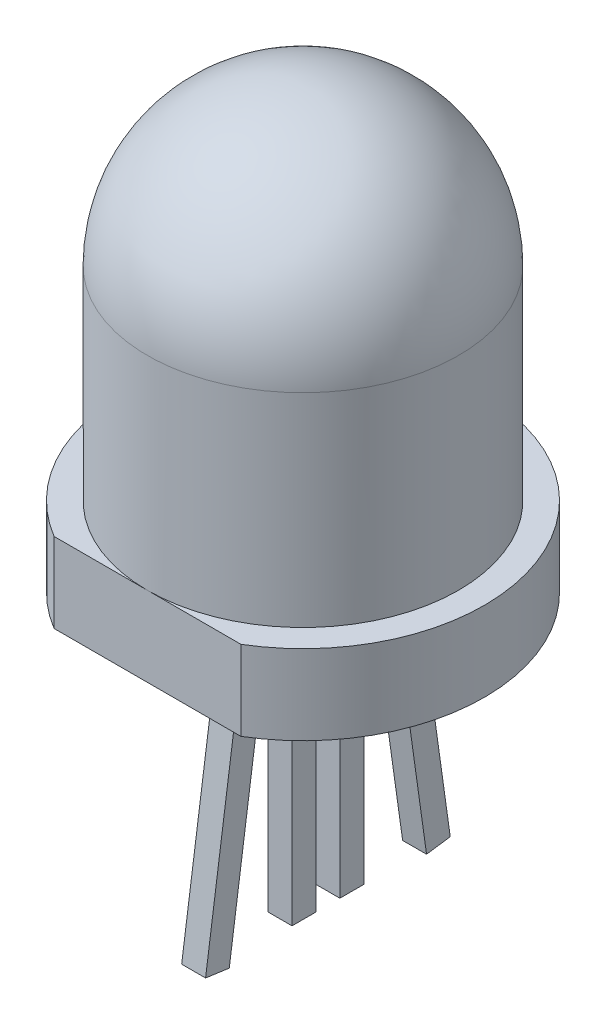
ISO-10303-21;
HEADER;
FILE_DESCRIPTION(('STEP AP214'),'2;1');
FILE_NAME('part.step','',(''),(''),'','','');
FILE_SCHEMA(('AUTOMOTIVE_DESIGN { 1 0 10303 214 1 1 1 1 }'));
ENDSEC;
DATA;
#1=APPLICATION_CONTEXT('core data for automotive mechanical design processes');
#2=APPLICATION_PROTOCOL_DEFINITION('international standard','automotive_design',2000,#1);
#3=PRODUCT_CONTEXT('',#1,'mechanical');
#4=PRODUCT('Part','Part','',(#3));
#5=PRODUCT_RELATED_PRODUCT_CATEGORY('part','',(#4));
#6=PRODUCT_DEFINITION_FORMATION('','',#4);
#7=PRODUCT_DEFINITION_CONTEXT('part definition',#1,'design');
#8=PRODUCT_DEFINITION('design','',#6,#7);
#9=PRODUCT_DEFINITION_SHAPE('','',#8);
#10=(LENGTH_UNIT() NAMED_UNIT(*) SI_UNIT(.MILLI.,.METRE.));
#11=(NAMED_UNIT(*) PLANE_ANGLE_UNIT() SI_UNIT($,.RADIAN.));
#12=(NAMED_UNIT(*) SI_UNIT($,.STERADIAN.) SOLID_ANGLE_UNIT());
#13=UNCERTAINTY_MEASURE_WITH_UNIT(LENGTH_MEASURE(1.E-05),#10,'distance_accuracy_value','');
#14=(GEOMETRIC_REPRESENTATION_CONTEXT(3) GLOBAL_UNCERTAINTY_ASSIGNED_CONTEXT((#13)) GLOBAL_UNIT_ASSIGNED_CONTEXT((#10,
#11,#12)) REPRESENTATION_CONTEXT('',''));
#15=CARTESIAN_POINT('',(0.,0.,0.));
#16=DIRECTION('',(0.,0.,1.));
#17=DIRECTION('',(1.,0.,0.));
#18=AXIS2_PLACEMENT_3D('',#15,#16,#17);
#19=CARTESIAN_POINT('',(0.,-2.,0.));
#20=DIRECTION('',(0.,-1.,0.));
#21=DIRECTION('',(0.,0.,-1.));
#22=AXIS2_PLACEMENT_3D('',#19,#20,#21);
#23=PLANE('',#22);
#24=DIRECTION('',(1.,0.,0.));
#25=VECTOR('',#24,1.);
#26=CARTESIAN_POINT('',(0.,-2.,1.78089654351117));
#27=LINE('',#26,#25);
#28=CARTESIAN_POINT('',(-0.3,-2.,1.78089654351117));
#29=VERTEX_POINT('',#28);
#30=CARTESIAN_POINT('',(0.3,-2.,1.78089654351117));
#31=VERTEX_POINT('',#30);
#32=EDGE_CURVE('E292',#29,#31,#27,.T.);
#33=ORIENTED_EDGE('',*,*,#32,.T.);
#34=DIRECTION('',(0.,0.,-1.));
#35=VECTOR('',#34,1.);
#36=CARTESIAN_POINT('',(0.3,-2.,0.));
#37=LINE('',#36,#35);
#38=CARTESIAN_POINT('',(0.3,-2.,1.175));
#39=VERTEX_POINT('',#38);
#40=EDGE_CURVE('E295',#31,#39,#37,.T.);
#41=ORIENTED_EDGE('',*,*,#40,.T.);
#42=DIRECTION('',(1.,0.,0.));
#43=VECTOR('',#42,1.);
#44=CARTESIAN_POINT('',(0.3,-2.,1.175));
#45=LINE('',#44,#43);
#46=CARTESIAN_POINT('',(-0.3,-2.,1.175));
#47=VERTEX_POINT('',#46);
#48=EDGE_CURVE('E181',#47,#39,#45,.T.);
#49=ORIENTED_EDGE('',*,*,#48,.F.);
#50=DIRECTION('',(0.,0.,1.));
#51=VECTOR('',#50,1.);
#52=CARTESIAN_POINT('',(-0.300000000000001,-2.,0.));
#53=LINE('',#52,#51);
#54=EDGE_CURVE('E289',#47,#29,#53,.T.);
#55=ORIENTED_EDGE('',*,*,#54,.T.);
#56=EDGE_LOOP('',(#33,#41,#49,#55));
#57=FACE_BOUND('',#56,.T.);
#58=DIRECTION('',(1.,0.,0.));
#59=VECTOR('',#58,1.);
#60=CARTESIAN_POINT('',(-0.3,-2.,-0.0250000000000005));
#61=LINE('',#60,#59);
#62=CARTESIAN_POINT('',(-0.3,-2.,-0.0250000000000005));
#63=VERTEX_POINT('',#62);
#64=CARTESIAN_POINT('',(0.3,-2.,-0.0250000000000004));
#65=VERTEX_POINT('',#64);
#66=EDGE_CURVE('E251',#63,#65,#61,.T.);
#67=ORIENTED_EDGE('',*,*,#66,.F.);
#68=DIRECTION('',(0.,0.,-1.));
#69=VECTOR('',#68,1.);
#70=CARTESIAN_POINT('',(-0.3,-2.,-0.0250000000000005));
#71=LINE('',#70,#69);
#72=CARTESIAN_POINT('',(-0.3,-2.,0.574999999999999));
#73=VERTEX_POINT('',#72);
#74=EDGE_CURVE('E237',#73,#63,#71,.T.);
#75=ORIENTED_EDGE('',*,*,#74,.F.);
#76=DIRECTION('',(-1.,0.,0.));
#77=VECTOR('',#76,1.);
#78=CARTESIAN_POINT('',(-0.3,-2.,0.574999999999999));
#79=LINE('',#78,#77);
#80=CARTESIAN_POINT('',(0.3,-2.,0.575));
#81=VERTEX_POINT('',#80);
#82=EDGE_CURVE('E242',#81,#73,#79,.T.);
#83=ORIENTED_EDGE('',*,*,#82,.F.);
#84=DIRECTION('',(0.,0.,1.));
#85=VECTOR('',#84,1.);
#86=CARTESIAN_POINT('',(0.3,-2.,-0.0250000000000004));
#87=LINE('',#86,#85);
#88=EDGE_CURVE('E253',#65,#81,#87,.T.);
#89=ORIENTED_EDGE('',*,*,#88,.F.);
#90=EDGE_LOOP('',(#67,#75,#83,#89));
#91=FACE_BOUND('',#90,.T.);
#92=CARTESIAN_POINT('',(0.,-2.,0.));
#93=DIRECTION('',(0.,-1.,0.));
#94=DIRECTION('',(0.,0.,-1.));
#95=AXIS2_PLACEMENT_3D('',#92,#93,#94);
#96=CIRCLE('',#95,4.55);
#97=CARTESIAN_POINT('',(-2.34360832905159,-2.,3.9));
#98=VERTEX_POINT('',#97);
#99=CARTESIAN_POINT('',(2.34360832905159,-2.,3.9));
#100=VERTEX_POINT('',#99);
#101=EDGE_CURVE('E267',#98,#100,#96,.T.);
#102=ORIENTED_EDGE('',*,*,#101,.T.);
#103=DIRECTION('',(-1.,0.,0.));
#104=VECTOR('',#103,1.);
#105=CARTESIAN_POINT('',(2.34360832905159,-2.,3.9));
#106=LINE('',#105,#104);
#107=EDGE_CURVE('E270',#100,#98,#106,.T.);
#108=ORIENTED_EDGE('',*,*,#107,.T.);
#109=EDGE_LOOP('',(#102,#108));
#110=FACE_BOUND('',#109,.T.);
#111=DIRECTION('',(-1.,0.,0.));
#112=VECTOR('',#111,1.);
#113=CARTESIAN_POINT('',(0.299999999999999,-2.,-0.625));
#114=LINE('',#113,#112);
#115=CARTESIAN_POINT('',(0.299999999999999,-2.,-0.625));
#116=VERTEX_POINT('',#115);
#117=CARTESIAN_POINT('',(-0.3,-2.,-0.625));
#118=VERTEX_POINT('',#117);
#119=EDGE_CURVE('E222',#116,#118,#114,.T.);
#120=ORIENTED_EDGE('',*,*,#119,.F.);
#121=DIRECTION('',(0.,0.,1.));
#122=VECTOR('',#121,1.);
#123=CARTESIAN_POINT('',(0.299999999999999,-2.,-1.225));
#124=LINE('',#123,#122);
#125=CARTESIAN_POINT('',(0.299999999999999,-2.,-1.225));
#126=VERTEX_POINT('',#125);
#127=EDGE_CURVE('E208',#126,#116,#124,.T.);
#128=ORIENTED_EDGE('',*,*,#127,.F.);
#129=DIRECTION('',(1.,0.,0.));
#130=VECTOR('',#129,1.);
#131=CARTESIAN_POINT('',(0.299999999999999,-2.,-1.225));
#132=LINE('',#131,#130);
#133=CARTESIAN_POINT('',(-0.3,-2.,-1.225));
#134=VERTEX_POINT('',#133);
#135=EDGE_CURVE('E213',#134,#126,#132,.T.);
#136=ORIENTED_EDGE('',*,*,#135,.F.);
#137=DIRECTION('',(0.,0.,-1.));
#138=VECTOR('',#137,1.);
#139=CARTESIAN_POINT('',(-0.3,-2.,-1.225));
#140=LINE('',#139,#138);
#141=EDGE_CURVE('E224',#118,#134,#140,.T.);
#142=ORIENTED_EDGE('',*,*,#141,.F.);
#143=EDGE_LOOP('',(#120,#128,#136,#142));
#144=FACE_BOUND('',#143,.T.);
#145=DIRECTION('',(-1.,0.,0.));
#146=VECTOR('',#145,1.);
#147=CARTESIAN_POINT('',(0.299999999999999,-2.,-1.825));
#148=LINE('',#147,#146);
#149=CARTESIAN_POINT('',(0.299999999999999,-2.,-1.82500000000001));
#150=VERTEX_POINT('',#149);
#151=CARTESIAN_POINT('',(-0.300000000000001,-2.,-1.825));
#152=VERTEX_POINT('',#151);
#153=EDGE_CURVE('E178',#150,#152,#148,.T.);
#154=ORIENTED_EDGE('',*,*,#153,.F.);
#155=DIRECTION('',(0.,0.,-1.));
#156=VECTOR('',#155,1.);
#157=CARTESIAN_POINT('',(0.299999999999999,-2.,0.));
#158=LINE('',#157,#156);
#159=CARTESIAN_POINT('',(0.299999999999999,-2.,-2.43089654351117));
#160=VERTEX_POINT('',#159);
#161=EDGE_CURVE('E11',#150,#160,#158,.T.);
#162=ORIENTED_EDGE('',*,*,#161,.T.);
#163=DIRECTION('',(-1.,0.,0.));
#164=VECTOR('',#163,1.);
#165=CARTESIAN_POINT('',(0.,-2.,-2.43089654351117));
#166=LINE('',#165,#164);
#167=CARTESIAN_POINT('',(-0.3,-2.,-2.43089654351117));
#168=VERTEX_POINT('',#167);
#169=EDGE_CURVE('E43',#160,#168,#166,.T.);
#170=ORIENTED_EDGE('',*,*,#169,.T.);
#171=DIRECTION('',(0.,0.,1.));
#172=VECTOR('',#171,1.);
#173=CARTESIAN_POINT('',(-0.300000000000001,-2.,0.));
#174=LINE('',#173,#172);
#175=EDGE_CURVE('E298',#168,#152,#174,.T.);
#176=ORIENTED_EDGE('',*,*,#175,.T.);
#177=EDGE_LOOP('',(#154,#162,#170,#176));
#178=FACE_BOUND('',#177,.T.);
#179=ADVANCED_FACE('F35',(#57,#91,#110,#144,#178),#23,.T.);
#180=CARTESIAN_POINT('',(0.,9.,0.));
#181=DIRECTION('',(0.,-1.,0.));
#182=DIRECTION('',(0.,0.,-1.));
#183=AXIS2_PLACEMENT_3D('',#180,#181,#182);
#184=CYLINDRICAL_SURFACE('',#183,3.9);
#185=CARTESIAN_POINT('',(0.,5.1,0.));
#186=DIRECTION('',(0.,-1.,0.));
#187=DIRECTION('',(0.,0.,-1.));
#188=AXIS2_PLACEMENT_3D('',#185,#186,#187);
#189=CIRCLE('',#188,3.9);
#190=CARTESIAN_POINT('',(0.,5.1,-3.9));
#191=VERTEX_POINT('',#190);
#192=EDGE_CURVE('E286',#191,#191,#189,.T.);
#193=ORIENTED_EDGE('',*,*,#192,.T.);
#194=EDGE_LOOP('',(#193));
#195=FACE_BOUND('',#194,.T.);
#196=CARTESIAN_POINT('',(0.,0.,0.));
#197=DIRECTION('',(0.,1.,0.));
#198=DIRECTION('',(0.,0.,1.));
#199=AXIS2_PLACEMENT_3D('',#196,#197,#198);
#200=CIRCLE('',#199,3.9);
#201=CARTESIAN_POINT('',(0.,0.,3.9));
#202=VERTEX_POINT('',#201);
#203=EDGE_CURVE('E283',#202,#202,#200,.T.);
#204=ORIENTED_EDGE('',*,*,#203,.T.);
#205=EDGE_LOOP('',(#204));
#206=FACE_BOUND('',#205,.T.);
#207=ADVANCED_FACE('F319',(#195,#206),#184,.T.);
#208=CARTESIAN_POINT('',(0.,5.1,0.));
#209=DIRECTION('',(0.,0.,1.));
#210=DIRECTION('',(1.,0.,0.));
#211=AXIS2_PLACEMENT_3D('',#208,#209,#210);
#212=SPHERICAL_SURFACE('',#211,3.9);
#213=CARTESIAN_POINT('',(0.,5.1,0.));
#214=DIRECTION('',(0.,-1.,0.));
#215=DIRECTION('',(0.,0.,-1.));
#216=AXIS2_PLACEMENT_3D('',#213,#214,#215);
#217=SPHERICAL_SURFACE('',#216,3.9);
#218=ORIENTED_EDGE('',*,*,#192,.F.);
#219=EDGE_LOOP('',(#218));
#220=FACE_BOUND('',#219,.T.);
#221=ADVANCED_FACE('F37',(#220),#217,.T.);
#222=CARTESIAN_POINT('',(0.,-2.,0.));
#223=DIRECTION('',(0.,1.,0.));
#224=DIRECTION('',(0.,0.,1.));
#225=AXIS2_PLACEMENT_3D('',#222,#223,#224);
#226=CYLINDRICAL_SURFACE('',#225,4.55);
#227=CARTESIAN_POINT('',(0.,0.,0.));
#228=DIRECTION('',(0.,-1.,0.));
#229=DIRECTION('',(0.,0.,-1.));
#230=AXIS2_PLACEMENT_3D('',#227,#228,#229);
#231=CIRCLE('',#230,4.55);
#232=CARTESIAN_POINT('',(-2.34360832905159,0.,3.9));
#233=VERTEX_POINT('',#232);
#234=CARTESIAN_POINT('',(2.34360832905159,0.,3.9));
#235=VERTEX_POINT('',#234);
#236=EDGE_CURVE('E266',#233,#235,#231,.T.);
#237=ORIENTED_EDGE('',*,*,#236,.T.);
#238=DIRECTION('',(0.,1.,0.));
#239=VECTOR('',#238,1.);
#240=CARTESIAN_POINT('',(2.34360832905159,-2.,3.9));
#241=LINE('',#240,#239);
#242=EDGE_CURVE('E280',#100,#235,#241,.T.);
#243=ORIENTED_EDGE('',*,*,#242,.F.);
#244=ORIENTED_EDGE('',*,*,#101,.F.);
#245=DIRECTION('',(0.,1.,0.));
#246=VECTOR('',#245,1.);
#247=CARTESIAN_POINT('',(-2.34360832905159,-2.,3.9));
#248=LINE('',#247,#246);
#249=EDGE_CURVE('E273',#98,#233,#248,.T.);
#250=ORIENTED_EDGE('',*,*,#249,.T.);
#251=EDGE_LOOP('',(#237,#243,#244,#250));
#252=FACE_BOUND('',#251,.T.);
#253=ADVANCED_FACE('F338',(#252),#226,.T.);
#254=CARTESIAN_POINT('',(2.34360832905159,-2.,3.9));
#255=DIRECTION('',(0.,0.,-1.));
#256=DIRECTION('',(-1.,0.,0.));
#257=AXIS2_PLACEMENT_3D('',#254,#255,#256);
#258=PLANE('',#257);
#259=DIRECTION('',(-1.,0.,0.));
#260=VECTOR('',#259,1.);
#261=CARTESIAN_POINT('',(2.34360832905159,0.,3.9));
#262=LINE('',#261,#260);
#263=EDGE_CURVE('E271',#235,#202,#262,.T.);
#264=ORIENTED_EDGE('',*,*,#263,.T.);
#265=EDGE_CURVE('E276',#202,#233,#262,.T.);
#266=ORIENTED_EDGE('',*,*,#265,.T.);
#267=ORIENTED_EDGE('',*,*,#249,.F.);
#268=ORIENTED_EDGE('',*,*,#107,.F.);
#269=ORIENTED_EDGE('',*,*,#242,.T.);
#270=EDGE_LOOP('',(#264,#266,#267,#268,#269));
#271=FACE_BOUND('',#270,.T.);
#272=ADVANCED_FACE('F334',(#271),#258,.F.);
#273=CARTESIAN_POINT('',(0.,0.,0.));
#274=DIRECTION('',(0.,-1.,0.));
#275=DIRECTION('',(0.,0.,-1.));
#276=AXIS2_PLACEMENT_3D('',#273,#274,#275);
#277=PLANE('',#276);
#278=ORIENTED_EDGE('',*,*,#265,.F.);
#279=ORIENTED_EDGE('',*,*,#203,.F.);
#280=ORIENTED_EDGE('',*,*,#263,.F.);
#281=ORIENTED_EDGE('',*,*,#236,.F.);
#282=EDGE_LOOP('',(#278,#279,#280,#281));
#283=FACE_BOUND('',#282,.T.);
#284=ADVANCED_FACE('F331',(#283),#277,.F.);
#285=CARTESIAN_POINT('',(-0.3,-8.8,-0.0250000000000005));
#286=DIRECTION('',(1.,0.,0.));
#287=DIRECTION('',(0.,0.,-1.));
#288=AXIS2_PLACEMENT_3D('',#285,#286,#287);
#289=PLANE('',#288);
#290=ORIENTED_EDGE('',*,*,#74,.T.);
#291=DIRECTION('',(0.,1.,0.));
#292=VECTOR('',#291,1.);
#293=CARTESIAN_POINT('',(-0.3,-8.8,-0.0250000000000005));
#294=LINE('',#293,#292);
#295=CARTESIAN_POINT('',(-0.3,-8.8,-0.0250000000000005));
#296=VERTEX_POINT('',#295);
#297=EDGE_CURVE('E264',#296,#63,#294,.T.);
#298=ORIENTED_EDGE('',*,*,#297,.F.);
#299=DIRECTION('',(0.,0.,-1.));
#300=VECTOR('',#299,1.);
#301=CARTESIAN_POINT('',(-0.3,-8.8,-0.0250000000000005));
#302=LINE('',#301,#300);
#303=CARTESIAN_POINT('',(-0.3,-8.8,0.574999999999999));
#304=VERTEX_POINT('',#303);
#305=EDGE_CURVE('E238',#304,#296,#302,.T.);
#306=ORIENTED_EDGE('',*,*,#305,.F.);
#307=DIRECTION('',(0.,1.,0.));
#308=VECTOR('',#307,1.);
#309=CARTESIAN_POINT('',(-0.3,-8.8,0.574999999999999));
#310=LINE('',#309,#308);
#311=EDGE_CURVE('E248',#304,#73,#310,.T.);
#312=ORIENTED_EDGE('',*,*,#311,.T.);
#313=EDGE_LOOP('',(#290,#298,#306,#312));
#314=FACE_BOUND('',#313,.T.);
#315=ADVANCED_FACE('F329',(#314),#289,.F.);
#316=CARTESIAN_POINT('',(-0.3,-8.8,-0.0250000000000005));
#317=DIRECTION('',(0.,0.,1.));
#318=DIRECTION('',(1.,0.,0.));
#319=AXIS2_PLACEMENT_3D('',#316,#317,#318);
#320=PLANE('',#319);
#321=ORIENTED_EDGE('',*,*,#66,.T.);
#322=DIRECTION('',(0.,1.,0.));
#323=VECTOR('',#322,1.);
#324=CARTESIAN_POINT('',(0.3,-8.8,-0.0250000000000004));
#325=LINE('',#324,#323);
#326=CARTESIAN_POINT('',(0.3,-8.8,-0.0250000000000004));
#327=VERTEX_POINT('',#326);
#328=EDGE_CURVE('E261',#327,#65,#325,.T.);
#329=ORIENTED_EDGE('',*,*,#328,.F.);
#330=DIRECTION('',(1.,0.,0.));
#331=VECTOR('',#330,1.);
#332=CARTESIAN_POINT('',(-0.3,-8.8,-0.0250000000000005));
#333=LINE('',#332,#331);
#334=EDGE_CURVE('E241',#296,#327,#333,.T.);
#335=ORIENTED_EDGE('',*,*,#334,.F.);
#336=ORIENTED_EDGE('',*,*,#297,.T.);
#337=EDGE_LOOP('',(#321,#329,#335,#336));
#338=FACE_BOUND('',#337,.T.);
#339=ADVANCED_FACE('F400',(#338),#320,.F.);
#340=CARTESIAN_POINT('',(0.3,-8.8,-0.0250000000000004));
#341=DIRECTION('',(-1.,0.,0.));
#342=DIRECTION('',(0.,0.,1.));
#343=AXIS2_PLACEMENT_3D('',#340,#341,#342);
#344=PLANE('',#343);
#345=ORIENTED_EDGE('',*,*,#88,.T.);
#346=DIRECTION('',(0.,1.,0.));
#347=VECTOR('',#346,1.);
#348=CARTESIAN_POINT('',(0.3,-8.8,0.575));
#349=LINE('',#348,#347);
#350=CARTESIAN_POINT('',(0.3,-8.8,0.575));
#351=VERTEX_POINT('',#350);
#352=EDGE_CURVE('E259',#351,#81,#349,.T.);
#353=ORIENTED_EDGE('',*,*,#352,.F.);
#354=DIRECTION('',(0.,0.,1.));
#355=VECTOR('',#354,1.);
#356=CARTESIAN_POINT('',(0.3,-8.8,-0.0250000000000004));
#357=LINE('',#356,#355);
#358=EDGE_CURVE('E244',#327,#351,#357,.T.);
#359=ORIENTED_EDGE('',*,*,#358,.F.);
#360=ORIENTED_EDGE('',*,*,#328,.T.);
#361=EDGE_LOOP('',(#345,#353,#359,#360));
#362=FACE_BOUND('',#361,.T.);
#363=ADVANCED_FACE('F397',(#362),#344,.F.);
#364=CARTESIAN_POINT('',(-0.3,-8.8,0.574999999999999));
#365=DIRECTION('',(0.,0.,-1.));
#366=DIRECTION('',(-1.,0.,0.));
#367=AXIS2_PLACEMENT_3D('',#364,#365,#366);
#368=PLANE('',#367);
#369=ORIENTED_EDGE('',*,*,#82,.T.);
#370=ORIENTED_EDGE('',*,*,#311,.F.);
#371=DIRECTION('',(-1.,0.,0.));
#372=VECTOR('',#371,1.);
#373=CARTESIAN_POINT('',(-0.3,-8.8,0.574999999999999));
#374=LINE('',#373,#372);
#375=EDGE_CURVE('E246',#351,#304,#374,.T.);
#376=ORIENTED_EDGE('',*,*,#375,.F.);
#377=ORIENTED_EDGE('',*,*,#352,.T.);
#378=EDGE_LOOP('',(#369,#370,#376,#377));
#379=FACE_BOUND('',#378,.T.);
#380=ADVANCED_FACE('F393',(#379),#368,.F.);
#381=CARTESIAN_POINT('',(0.,-8.8,0.));
#382=DIRECTION('',(0.,1.,0.));
#383=DIRECTION('',(0.,0.,1.));
#384=AXIS2_PLACEMENT_3D('',#381,#382,#383);
#385=PLANE('',#384);
#386=ORIENTED_EDGE('',*,*,#305,.T.);
#387=ORIENTED_EDGE('',*,*,#334,.T.);
#388=ORIENTED_EDGE('',*,*,#358,.T.);
#389=ORIENTED_EDGE('',*,*,#375,.T.);
#390=EDGE_LOOP('',(#386,#387,#388,#389));
#391=FACE_BOUND('',#390,.T.);
#392=ADVANCED_FACE('F390',(#391),#385,.F.);
#393=CARTESIAN_POINT('',(0.299999999999999,-8.8,-1.225));
#394=DIRECTION('',(-1.,0.,0.));
#395=DIRECTION('',(0.,0.,1.));
#396=AXIS2_PLACEMENT_3D('',#393,#394,#395);
#397=PLANE('',#396);
#398=ORIENTED_EDGE('',*,*,#127,.T.);
#399=DIRECTION('',(0.,1.,0.));
#400=VECTOR('',#399,1.);
#401=CARTESIAN_POINT('',(0.299999999999999,-8.8,-0.625));
#402=LINE('',#401,#400);
#403=CARTESIAN_POINT('',(0.299999999999999,-8.8,-0.625));
#404=VERTEX_POINT('',#403);
#405=EDGE_CURVE('E235',#404,#116,#402,.T.);
#406=ORIENTED_EDGE('',*,*,#405,.F.);
#407=DIRECTION('',(0.,0.,1.));
#408=VECTOR('',#407,1.);
#409=CARTESIAN_POINT('',(0.299999999999999,-8.8,-1.225));
#410=LINE('',#409,#408);
#411=CARTESIAN_POINT('',(0.299999999999999,-8.8,-1.225));
#412=VERTEX_POINT('',#411);
#413=EDGE_CURVE('E209',#412,#404,#410,.T.);
#414=ORIENTED_EDGE('',*,*,#413,.F.);
#415=DIRECTION('',(0.,1.,0.));
#416=VECTOR('',#415,1.);
#417=CARTESIAN_POINT('',(0.299999999999999,-8.8,-1.225));
#418=LINE('',#417,#416);
#419=EDGE_CURVE('E219',#412,#126,#418,.T.);
#420=ORIENTED_EDGE('',*,*,#419,.T.);
#421=EDGE_LOOP('',(#398,#406,#414,#420));
#422=FACE_BOUND('',#421,.T.);
#423=ADVANCED_FACE('F372',(#422),#397,.F.);
#424=CARTESIAN_POINT('',(0.299999999999999,-8.8,-0.625));
#425=DIRECTION('',(0.,0.,-1.));
#426=DIRECTION('',(-1.,0.,0.));
#427=AXIS2_PLACEMENT_3D('',#424,#425,#426);
#428=PLANE('',#427);
#429=ORIENTED_EDGE('',*,*,#119,.T.);
#430=DIRECTION('',(0.,1.,0.));
#431=VECTOR('',#430,1.);
#432=CARTESIAN_POINT('',(-0.3,-8.8,-0.625));
#433=LINE('',#432,#431);
#434=CARTESIAN_POINT('',(-0.3,-8.8,-0.625));
#435=VERTEX_POINT('',#434);
#436=EDGE_CURVE('E232',#435,#118,#433,.T.);
#437=ORIENTED_EDGE('',*,*,#436,.F.);
#438=DIRECTION('',(-1.,0.,0.));
#439=VECTOR('',#438,1.);
#440=CARTESIAN_POINT('',(0.299999999999999,-8.8,-0.625));
#441=LINE('',#440,#439);
#442=EDGE_CURVE('E212',#404,#435,#441,.T.);
#443=ORIENTED_EDGE('',*,*,#442,.F.);
#444=ORIENTED_EDGE('',*,*,#405,.T.);
#445=EDGE_LOOP('',(#429,#437,#443,#444));
#446=FACE_BOUND('',#445,.T.);
#447=ADVANCED_FACE('F360',(#446),#428,.F.);
#448=CARTESIAN_POINT('',(-0.3,-8.8,-1.225));
#449=DIRECTION('',(1.,0.,0.));
#450=DIRECTION('',(0.,0.,-1.));
#451=AXIS2_PLACEMENT_3D('',#448,#449,#450);
#452=PLANE('',#451);
#453=ORIENTED_EDGE('',*,*,#141,.T.);
#454=DIRECTION('',(0.,1.,0.));
#455=VECTOR('',#454,1.);
#456=CARTESIAN_POINT('',(-0.3,-8.8,-1.225));
#457=LINE('',#456,#455);
#458=CARTESIAN_POINT('',(-0.3,-8.8,-1.225));
#459=VERTEX_POINT('',#458);
#460=EDGE_CURVE('E230',#459,#134,#457,.T.);
#461=ORIENTED_EDGE('',*,*,#460,.F.);
#462=DIRECTION('',(0.,0.,-1.));
#463=VECTOR('',#462,1.);
#464=CARTESIAN_POINT('',(-0.3,-8.8,-1.225));
#465=LINE('',#464,#463);
#466=EDGE_CURVE('E215',#435,#459,#465,.T.);
#467=ORIENTED_EDGE('',*,*,#466,.F.);
#468=ORIENTED_EDGE('',*,*,#436,.T.);
#469=EDGE_LOOP('',(#453,#461,#467,#468));
#470=FACE_BOUND('',#469,.T.);
#471=ADVANCED_FACE('F364',(#470),#452,.F.);
#472=CARTESIAN_POINT('',(0.299999999999999,-8.8,-1.225));
#473=DIRECTION('',(0.,0.,1.));
#474=DIRECTION('',(1.,0.,0.));
#475=AXIS2_PLACEMENT_3D('',#472,#473,#474);
#476=PLANE('',#475);
#477=ORIENTED_EDGE('',*,*,#135,.T.);
#478=ORIENTED_EDGE('',*,*,#419,.F.);
#479=DIRECTION('',(1.,0.,0.));
#480=VECTOR('',#479,1.);
#481=CARTESIAN_POINT('',(0.299999999999999,-8.8,-1.225));
#482=LINE('',#481,#480);
#483=EDGE_CURVE('E217',#459,#412,#482,.T.);
#484=ORIENTED_EDGE('',*,*,#483,.F.);
#485=ORIENTED_EDGE('',*,*,#460,.T.);
#486=EDGE_LOOP('',(#477,#478,#484,#485));
#487=FACE_BOUND('',#486,.T.);
#488=ADVANCED_FACE('F374',(#487),#476,.F.);
#489=CARTESIAN_POINT('',(0.,-8.8,0.));
#490=DIRECTION('',(0.,-1.,0.));
#491=DIRECTION('',(0.,0.,-1.));
#492=AXIS2_PLACEMENT_3D('',#489,#490,#491);
#493=PLANE('',#492);
#494=ORIENTED_EDGE('',*,*,#413,.T.);
#495=ORIENTED_EDGE('',*,*,#442,.T.);
#496=ORIENTED_EDGE('',*,*,#466,.T.);
#497=ORIENTED_EDGE('',*,*,#483,.T.);
#498=EDGE_LOOP('',(#494,#495,#496,#497));
#499=FACE_BOUND('',#498,.T.);
#500=ADVANCED_FACE('F368',(#499),#493,.T.);
#501=CARTESIAN_POINT('',(0.3,-8.93187648119099,2.14921170672046));
#502=DIRECTION('',(-1.,0.,0.));
#503=DIRECTION('',(0.,0.,1.));
#504=AXIS2_PLACEMENT_3D('',#501,#502,#503);
#505=PLANE('',#504);
#506=ORIENTED_EDGE('',*,*,#40,.F.);
#507=DIRECTION('',(0.,0.99026806874157,-0.139173100960066));
#508=VECTOR('',#507,1.);
#509=CARTESIAN_POINT('',(0.3,-8.84837262061495,2.7433725479654));
#510=LINE('',#509,#508);
#511=CARTESIAN_POINT('',(0.3,-8.84837262061495,2.7433725479654));
#512=VERTEX_POINT('',#511);
#513=EDGE_CURVE('E205',#512,#31,#510,.T.);
#514=ORIENTED_EDGE('',*,*,#513,.F.);
#515=DIRECTION('',(0.,0.139173100960065,0.99026806874157));
#516=VECTOR('',#515,1.);
#517=CARTESIAN_POINT('',(0.3,-8.93187648119099,2.14921170672046));
#518=LINE('',#517,#516);
#519=CARTESIAN_POINT('',(0.3,-8.93187648119099,2.14921170672046));
#520=VERTEX_POINT('',#519);
#521=EDGE_CURVE('E183',#520,#512,#518,.T.);
#522=ORIENTED_EDGE('',*,*,#521,.F.);
#523=DIRECTION('',(0.,0.99026806874157,-0.139173100960066));
#524=VECTOR('',#523,1.);
#525=CARTESIAN_POINT('',(0.3,-8.93187648119099,2.14921170672046));
#526=LINE('',#525,#524);
#527=EDGE_CURVE('E196',#520,#39,#526,.T.);
#528=ORIENTED_EDGE('',*,*,#527,.T.);
#529=EDGE_LOOP('',(#506,#514,#522,#528));
#530=FACE_BOUND('',#529,.T.);
#531=ADVANCED_FACE('F381',(#530),#505,.F.);
#532=CARTESIAN_POINT('',(0.3,-8.84837262061495,2.7433725479654));
#533=DIRECTION('',(0.,-0.139173100960066,-0.99026806874157));
#534=DIRECTION('',(0.,0.99026806874157,-0.139173100960066));
#535=AXIS2_PLACEMENT_3D('',#532,#533,#534);
#536=PLANE('',#535);
#537=ORIENTED_EDGE('',*,*,#32,.F.);
#538=DIRECTION('',(0.,0.99026806874157,-0.139173100960066));
#539=VECTOR('',#538,1.);
#540=CARTESIAN_POINT('',(-0.3,-8.84837262061495,2.7433725479654));
#541=LINE('',#540,#539);
#542=CARTESIAN_POINT('',(-0.3,-8.84837262061495,2.7433725479654));
#543=VERTEX_POINT('',#542);
#544=EDGE_CURVE('E202',#543,#29,#541,.T.);
#545=ORIENTED_EDGE('',*,*,#544,.F.);
#546=DIRECTION('',(-1.,0.,0.));
#547=VECTOR('',#546,1.);
#548=CARTESIAN_POINT('',(0.3,-8.84837262061495,2.7433725479654));
#549=LINE('',#548,#547);
#550=EDGE_CURVE('E191',#512,#543,#549,.T.);
#551=ORIENTED_EDGE('',*,*,#550,.F.);
#552=ORIENTED_EDGE('',*,*,#513,.T.);
#553=EDGE_LOOP('',(#537,#545,#551,#552));
#554=FACE_BOUND('',#553,.T.);
#555=ADVANCED_FACE('F512',(#554),#536,.F.);
#556=CARTESIAN_POINT('',(-0.3,-8.93187648119099,2.14921170672046));
#557=DIRECTION('',(1.,0.,0.));
#558=DIRECTION('',(0.,0.,-1.));
#559=AXIS2_PLACEMENT_3D('',#556,#557,#558);
#560=PLANE('',#559);
#561=ORIENTED_EDGE('',*,*,#54,.F.);
#562=DIRECTION('',(0.,0.99026806874157,-0.139173100960066));
#563=VECTOR('',#562,1.);
#564=CARTESIAN_POINT('',(-0.3,-8.93187648119099,2.14921170672046));
#565=LINE('',#564,#563);
#566=CARTESIAN_POINT('',(-0.3,-8.93187648119099,2.14921170672046));
#567=VERTEX_POINT('',#566);
#568=EDGE_CURVE('E200',#567,#47,#565,.T.);
#569=ORIENTED_EDGE('',*,*,#568,.F.);
#570=DIRECTION('',(0.,-0.139173100960065,-0.99026806874157));
#571=VECTOR('',#570,1.);
#572=CARTESIAN_POINT('',(-0.3,-8.93187648119099,2.14921170672046));
#573=LINE('',#572,#571);
#574=EDGE_CURVE('E193',#543,#567,#573,.T.);
#575=ORIENTED_EDGE('',*,*,#574,.F.);
#576=ORIENTED_EDGE('',*,*,#544,.T.);
#577=EDGE_LOOP('',(#561,#569,#575,#576));
#578=FACE_BOUND('',#577,.T.);
#579=ADVANCED_FACE('F520',(#578),#560,.F.);
#580=CARTESIAN_POINT('',(0.3,-8.93187648119099,2.14921170672046));
#581=DIRECTION('',(0.,0.139173100960066,0.99026806874157));
#582=DIRECTION('',(0.,-0.99026806874157,0.139173100960066));
#583=AXIS2_PLACEMENT_3D('',#580,#581,#582);
#584=PLANE('',#583);
#585=ORIENTED_EDGE('',*,*,#48,.T.);
#586=ORIENTED_EDGE('',*,*,#527,.F.);
#587=DIRECTION('',(1.,0.,0.));
#588=VECTOR('',#587,1.);
#589=CARTESIAN_POINT('',(0.3,-8.93187648119099,2.14921170672046));
#590=LINE('',#589,#588);
#591=EDGE_CURVE('E195',#567,#520,#590,.T.);
#592=ORIENTED_EDGE('',*,*,#591,.F.);
#593=ORIENTED_EDGE('',*,*,#568,.T.);
#594=EDGE_LOOP('',(#585,#586,#592,#593));
#595=FACE_BOUND('',#594,.T.);
#596=ADVANCED_FACE('F529',(#595),#584,.F.);
#597=CARTESIAN_POINT('',(0.,-9.0550751236718,1.2726078161737));
#598=DIRECTION('',(0.,-0.99026806874157,0.139173100960065));
#599=DIRECTION('',(0.,-0.139173100960065,-0.99026806874157));
#600=AXIS2_PLACEMENT_3D('',#597,#598,#599);
#601=PLANE('',#600);
#602=ORIENTED_EDGE('',*,*,#521,.T.);
#603=ORIENTED_EDGE('',*,*,#550,.T.);
#604=ORIENTED_EDGE('',*,*,#574,.T.);
#605=ORIENTED_EDGE('',*,*,#591,.T.);
#606=EDGE_LOOP('',(#602,#603,#604,#605));
#607=FACE_BOUND('',#606,.T.);
#608=ADVANCED_FACE('F538',(#607),#601,.T.);
#609=CARTESIAN_POINT('',(0.299999999999999,-8.93187648119099,-2.79921170672046));
#610=DIRECTION('',(-1.,0.,0.));
#611=DIRECTION('',(0.,0.,1.));
#612=AXIS2_PLACEMENT_3D('',#609,#610,#611);
#613=PLANE('',#612);
#614=ORIENTED_EDGE('',*,*,#161,.F.);
#615=DIRECTION('',(0.,0.99026806874157,0.139173100960066));
#616=VECTOR('',#615,1.);
#617=CARTESIAN_POINT('',(0.299999999999999,-8.93187648119099,-2.79921170672046));
#618=LINE('',#617,#616);
#619=CARTESIAN_POINT('',(0.299999999999999,-8.93187648119099,-2.79921170672046));
#620=VERTEX_POINT('',#619);
#621=EDGE_CURVE('E163',#620,#150,#618,.T.);
#622=ORIENTED_EDGE('',*,*,#621,.F.);
#623=DIRECTION('',(0.,-0.139173100960066,0.99026806874157));
#624=VECTOR('',#623,1.);
#625=CARTESIAN_POINT('',(0.299999999999999,-8.93187648119099,-2.79921170672046));
#626=LINE('',#625,#624);
#627=CARTESIAN_POINT('',(0.299999999999999,-8.84837262061495,-3.3933725479654));
#628=VERTEX_POINT('',#627);
#629=EDGE_CURVE('E169',#628,#620,#626,.T.);
#630=ORIENTED_EDGE('',*,*,#629,.F.);
#631=DIRECTION('',(0.,0.99026806874157,0.139173100960066));
#632=VECTOR('',#631,1.);
#633=CARTESIAN_POINT('',(0.299999999999999,-8.84837262061495,-3.3933725479654));
#634=LINE('',#633,#632);
#635=EDGE_CURVE('E305',#628,#160,#634,.T.);
#636=ORIENTED_EDGE('',*,*,#635,.T.);
#637=EDGE_LOOP('',(#614,#622,#630,#636));
#638=FACE_BOUND('',#637,.T.);
#639=ADVANCED_FACE('F180',(#638),#613,.F.);
#640=CARTESIAN_POINT('',(0.299999999999999,-8.93187648119099,-2.79921170672046));
#641=DIRECTION('',(0.,0.139173100960066,-0.99026806874157));
#642=DIRECTION('',(0.,0.99026806874157,0.139173100960066));
#643=AXIS2_PLACEMENT_3D('',#640,#641,#642);
#644=PLANE('',#643);
#645=ORIENTED_EDGE('',*,*,#153,.T.);
#646=DIRECTION('',(0.,0.99026806874157,0.139173100960066));
#647=VECTOR('',#646,1.);
#648=CARTESIAN_POINT('',(-0.300000000000001,-8.93187648119099,-2.79921170672046));
#649=LINE('',#648,#647);
#650=CARTESIAN_POINT('',(-0.300000000000001,-8.93187648119099,-2.79921170672046));
#651=VERTEX_POINT('',#650);
#652=EDGE_CURVE('E165',#651,#152,#649,.T.);
#653=ORIENTED_EDGE('',*,*,#652,.F.);
#654=DIRECTION('',(-1.,0.,0.));
#655=VECTOR('',#654,1.);
#656=CARTESIAN_POINT('',(0.299999999999999,-8.93187648119099,-2.79921170672046));
#657=LINE('',#656,#655);
#658=EDGE_CURVE('E158',#620,#651,#657,.T.);
#659=ORIENTED_EDGE('',*,*,#658,.F.);
#660=ORIENTED_EDGE('',*,*,#621,.T.);
#661=EDGE_LOOP('',(#645,#653,#659,#660));
#662=FACE_BOUND('',#661,.T.);
#663=ADVANCED_FACE('F161',(#662),#644,.F.);
#664=CARTESIAN_POINT('',(-0.300000000000001,-8.93187648119099,-2.79921170672046));
#665=DIRECTION('',(1.,0.,0.));
#666=DIRECTION('',(0.,0.,-1.));
#667=AXIS2_PLACEMENT_3D('',#664,#665,#666);
#668=PLANE('',#667);
#669=ORIENTED_EDGE('',*,*,#175,.F.);
#670=DIRECTION('',(0.,0.99026806874157,0.139173100960066));
#671=VECTOR('',#670,1.);
#672=CARTESIAN_POINT('',(-0.3,-8.84837262061495,-3.3933725479654));
#673=LINE('',#672,#671);
#674=CARTESIAN_POINT('',(-0.3,-8.84837262061495,-3.3933725479654));
#675=VERTEX_POINT('',#674);
#676=EDGE_CURVE('E185',#675,#168,#673,.T.);
#677=ORIENTED_EDGE('',*,*,#676,.F.);
#678=DIRECTION('',(0.,0.139173100960066,-0.99026806874157));
#679=VECTOR('',#678,1.);
#680=CARTESIAN_POINT('',(-0.300000000000001,-8.93187648119099,-2.79921170672046));
#681=LINE('',#680,#679);
#682=EDGE_CURVE('E168',#651,#675,#681,.T.);
#683=ORIENTED_EDGE('',*,*,#682,.F.);
#684=ORIENTED_EDGE('',*,*,#652,.T.);
#685=EDGE_LOOP('',(#669,#677,#683,#684));
#686=FACE_BOUND('',#685,.T.);
#687=ADVANCED_FACE('F303',(#686),#668,.F.);
#688=CARTESIAN_POINT('',(0.299999999999999,-8.84837262061495,-3.3933725479654));
#689=DIRECTION('',(0.,-0.139173100960066,0.99026806874157));
#690=DIRECTION('',(0.,-0.99026806874157,-0.139173100960066));
#691=AXIS2_PLACEMENT_3D('',#688,#689,#690);
#692=PLANE('',#691);
#693=ORIENTED_EDGE('',*,*,#169,.F.);
#694=ORIENTED_EDGE('',*,*,#635,.F.);
#695=DIRECTION('',(1.,0.,0.));
#696=VECTOR('',#695,1.);
#697=CARTESIAN_POINT('',(0.299999999999999,-8.84837262061495,-3.3933725479654));
#698=LINE('',#697,#696);
#699=EDGE_CURVE('E174',#675,#628,#698,.T.);
#700=ORIENTED_EDGE('',*,*,#699,.F.);
#701=ORIENTED_EDGE('',*,*,#676,.T.);
#702=EDGE_LOOP('',(#693,#694,#700,#701));
#703=FACE_BOUND('',#702,.T.);
#704=ADVANCED_FACE('F309',(#703),#692,.F.);
#705=CARTESIAN_POINT('',(0.,-9.14465726431232,-1.28519776499375));
#706=DIRECTION('',(0.,0.99026806874157,0.139173100960066));
#707=DIRECTION('',(0.,-0.139173100960066,0.99026806874157));
#708=AXIS2_PLACEMENT_3D('',#705,#706,#707);
#709=PLANE('',#708);
#710=ORIENTED_EDGE('',*,*,#629,.T.);
#711=ORIENTED_EDGE('',*,*,#658,.T.);
#712=ORIENTED_EDGE('',*,*,#682,.T.);
#713=ORIENTED_EDGE('',*,*,#699,.T.);
#714=EDGE_LOOP('',(#710,#711,#712,#713));
#715=FACE_BOUND('',#714,.T.);
#716=ADVANCED_FACE('F172',(#715),#709,.F.);
#717=CLOSED_SHELL('',(#179,#207,#221,#253,#272,#284,#315,#339,#363,#380,#392,#423,#447,#471,
#488,#500,#531,#555,#579,#596,#608,#639,#663,#687,#704,#716));
#718=MANIFOLD_SOLID_BREP('B2',#717);
#719=ADVANCED_BREP_SHAPE_REPRESENTATION('',(#18,#718),#14);
#720=SHAPE_DEFINITION_REPRESENTATION(#9,#719);
ENDSEC;
END-ISO-10303-21;
